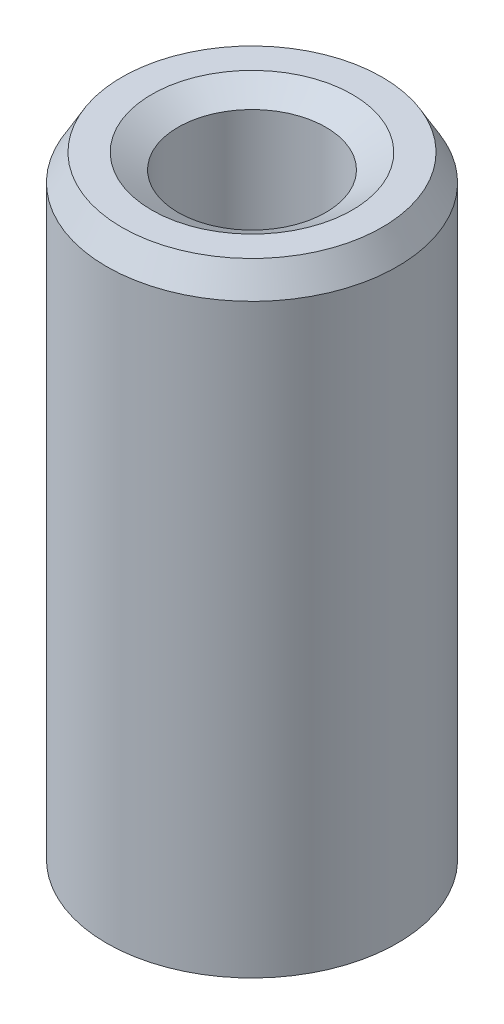
ISO-10303-21;
HEADER;
FILE_DESCRIPTION(('STEP AP214'),'2;1');
FILE_NAME('part.step','',(''),(''),'','','');
FILE_SCHEMA(('AUTOMOTIVE_DESIGN { 1 0 10303 214 1 1 1 1 }'));
ENDSEC;
DATA;
#1=APPLICATION_CONTEXT('core data for automotive mechanical design processes');
#2=APPLICATION_PROTOCOL_DEFINITION('international standard','automotive_design',2000,#1);
#3=PRODUCT_CONTEXT('',#1,'mechanical');
#4=PRODUCT('Part','Part','',(#3));
#5=PRODUCT_RELATED_PRODUCT_CATEGORY('part','',(#4));
#6=PRODUCT_DEFINITION_FORMATION('','',#4);
#7=PRODUCT_DEFINITION_CONTEXT('part definition',#1,'design');
#8=PRODUCT_DEFINITION('design','',#6,#7);
#9=PRODUCT_DEFINITION_SHAPE('','',#8);
#10=(LENGTH_UNIT() NAMED_UNIT(*) SI_UNIT(.MILLI.,.METRE.));
#11=(NAMED_UNIT(*) PLANE_ANGLE_UNIT() SI_UNIT($,.RADIAN.));
#12=(NAMED_UNIT(*) SI_UNIT($,.STERADIAN.) SOLID_ANGLE_UNIT());
#13=UNCERTAINTY_MEASURE_WITH_UNIT(LENGTH_MEASURE(1.E-05),#10,'distance_accuracy_value','');
#14=(GEOMETRIC_REPRESENTATION_CONTEXT(3) GLOBAL_UNCERTAINTY_ASSIGNED_CONTEXT((#13)) GLOBAL_UNIT_ASSIGNED_CONTEXT((#10,
#11,#12)) REPRESENTATION_CONTEXT('',''));
#15=CARTESIAN_POINT('',(0.,0.,0.));
#16=DIRECTION('',(0.,0.,1.));
#17=DIRECTION('',(1.,0.,0.));
#18=AXIS2_PLACEMENT_3D('',#15,#16,#17);
#19=CARTESIAN_POINT('',(0.,32.3775857218825,0.));
#20=DIRECTION('',(0.,-1.,0.));
#21=DIRECTION('',(0.,0.,-1.));
#22=AXIS2_PLACEMENT_3D('',#19,#20,#21);
#23=CYLINDRICAL_SURFACE('',#22,7.5);
#24=CARTESIAN_POINT('',(0.,0.785641217091529,0.));
#25=DIRECTION('',(0.,1.,0.));
#26=DIRECTION('',(0.,0.,1.));
#27=AXIS2_PLACEMENT_3D('',#24,#25,#26);
#28=CIRCLE('',#27,7.5);
#29=CARTESIAN_POINT('',(0.,0.785641217091529,7.5));
#30=VERTEX_POINT('',#29);
#31=EDGE_CURVE('E10',#30,#30,#28,.T.);
#32=ORIENTED_EDGE('',*,*,#31,.T.);
#33=EDGE_LOOP('',(#32));
#34=FACE_BOUND('',#33,.T.);
#35=CARTESIAN_POINT('',(0.,31.0168152173597,0.));
#36=DIRECTION('',(0.,1.,0.));
#37=DIRECTION('',(0.,0.,1.));
#38=AXIS2_PLACEMENT_3D('',#35,#36,#37);
#39=CIRCLE('',#38,7.5);
#40=CARTESIAN_POINT('',(0.,31.0168152173597,7.5));
#41=VERTEX_POINT('',#40);
#42=EDGE_CURVE('E50',#41,#41,#39,.F.);
#43=ORIENTED_EDGE('',*,*,#42,.T.);
#44=EDGE_LOOP('',(#43));
#45=FACE_BOUND('',#44,.T.);
#46=ADVANCED_FACE('F39',(#34,#45),#23,.T.);
#47=CARTESIAN_POINT('',(0.,32.3775857218825,0.));
#48=DIRECTION('',(0.,1.,0.));
#49=DIRECTION('',(0.,0.,1.));
#50=AXIS2_PLACEMENT_3D('',#47,#48,#49);
#51=PLANE('',#50);
#52=CARTESIAN_POINT('',(0.,32.3775857218825,0.));
#53=DIRECTION('',(0.,1.,0.));
#54=DIRECTION('',(0.,0.,1.));
#55=AXIS2_PLACEMENT_3D('',#52,#53,#54);
#56=CIRCLE('',#55,5.1731852317313);
#57=CARTESIAN_POINT('',(0.,32.3775857218825,5.1731852317313));
#58=VERTEX_POINT('',#57);
#59=EDGE_CURVE('E58',#58,#58,#56,.F.);
#60=ORIENTED_EDGE('',*,*,#59,.T.);
#61=EDGE_LOOP('',(#60));
#62=FACE_BOUND('',#61,.T.);
#63=CARTESIAN_POINT('',(0.,32.3775857218825,0.));
#64=DIRECTION('',(0.,1.,0.));
#65=DIRECTION('',(0.,0.,1.));
#66=AXIS2_PLACEMENT_3D('',#63,#64,#65);
#67=CIRCLE('',#66,6.71435878290846);
#68=CARTESIAN_POINT('',(0.,32.3775857218825,6.71435878290846));
#69=VERTEX_POINT('',#68);
#70=EDGE_CURVE('E61',#69,#69,#67,.T.);
#71=ORIENTED_EDGE('',*,*,#70,.T.);
#72=EDGE_LOOP('',(#71));
#73=FACE_BOUND('',#72,.T.);
#74=ADVANCED_FACE('F88',(#62,#73),#51,.T.);
#75=CARTESIAN_POINT('',(0.,0.,0.));
#76=DIRECTION('',(0.,1.,0.));
#77=DIRECTION('',(0.,0.,1.));
#78=AXIS2_PLACEMENT_3D('',#75,#76,#77);
#79=PLANE('',#78);
#80=CARTESIAN_POINT('',(0.,0.,0.));
#81=DIRECTION('',(0.,1.,0.));
#82=DIRECTION('',(0.,0.,1.));
#83=AXIS2_PLACEMENT_3D('',#80,#81,#82);
#84=CIRCLE('',#83,4.59805594430004);
#85=CARTESIAN_POINT('',(0.,0.,4.59805594430004));
#86=VERTEX_POINT('',#85);
#87=EDGE_CURVE('E51',#86,#86,#84,.T.);
#88=ORIENTED_EDGE('',*,*,#87,.T.);
#89=EDGE_LOOP('',(#88));
#90=FACE_BOUND('',#89,.T.);
#91=CARTESIAN_POINT('',(0.,0.,0.));
#92=DIRECTION('',(0.,1.,0.));
#93=DIRECTION('',(0.,0.,1.));
#94=AXIS2_PLACEMENT_3D('',#91,#92,#93);
#95=CIRCLE('',#94,6.13922949547721);
#96=CARTESIAN_POINT('',(0.,0.,6.13922949547721));
#97=VERTEX_POINT('',#96);
#98=EDGE_CURVE('E54',#97,#97,#95,.F.);
#99=ORIENTED_EDGE('',*,*,#98,.T.);
#100=EDGE_LOOP('',(#99));
#101=FACE_BOUND('',#100,.T.);
#102=ADVANCED_FACE('F83',(#90,#101),#79,.F.);
#103=CARTESIAN_POINT('',(0.,32.3775857218825,0.));
#104=DIRECTION('',(0.,-1.,0.));
#105=DIRECTION('',(0.,0.,-1.));
#106=AXIS2_PLACEMENT_3D('',#103,#104,#105);
#107=CYLINDRICAL_SURFACE('',#106,3.8124147272085);
#108=CARTESIAN_POINT('',(0.,31.591944504791,0.));
#109=DIRECTION('',(0.,1.,0.));
#110=DIRECTION('',(0.,0.,1.));
#111=AXIS2_PLACEMENT_3D('',#108,#109,#110);
#112=CIRCLE('',#111,3.8124147272085);
#113=CARTESIAN_POINT('',(0.,31.5919445047909,3.81241472720849));
#114=VERTEX_POINT('',#113);
#115=EDGE_CURVE('E67',#114,#114,#112,.T.);
#116=ORIENTED_EDGE('',*,*,#115,.T.);
#117=EDGE_LOOP('',(#116));
#118=FACE_BOUND('',#117,.T.);
#119=CARTESIAN_POINT('',(0.,1.3607705045228,0.));
#120=DIRECTION('',(0.,1.,0.));
#121=DIRECTION('',(0.,0.,1.));
#122=AXIS2_PLACEMENT_3D('',#119,#120,#121);
#123=CIRCLE('',#122,3.8124147272085);
#124=CARTESIAN_POINT('',(0.,1.3607705045228,3.8124147272085));
#125=VERTEX_POINT('',#124);
#126=EDGE_CURVE('E69',#125,#125,#123,.F.);
#127=ORIENTED_EDGE('',*,*,#126,.T.);
#128=EDGE_LOOP('',(#127));
#129=FACE_BOUND('',#128,.T.);
#130=ADVANCED_FACE('F71',(#118,#129),#107,.F.);
#131=CARTESIAN_POINT('',(0.,31.591944504791,0.));
#132=DIRECTION('',(0.,1.,0.));
#133=DIRECTION('',(0.,0.,1.));
#134=AXIS2_PLACEMENT_3D('',#131,#132,#133);
#135=CONICAL_SURFACE('',#134,3.8124147272085,1.0471975511966);
#136=CARTESIAN_POINT('',(0.,32.3775857218825,5.1731852317313));
#137=CARTESIAN_POINT('',(0.,32.3694019592045,5.15901053897585));
#138=CARTESIAN_POINT('',(0.,32.3612181965264,5.14483584622041));
#139=CARTESIAN_POINT('',(0.,32.3448506711703,5.11648646070952));
#140=CARTESIAN_POINT('',(0.,32.3366669084923,5.10231176795407));
#141=CARTESIAN_POINT('',(0.,32.3202993831362,5.07396238244318));
#142=CARTESIAN_POINT('',(0.,32.3121156204582,5.05978768968773));
#143=CARTESIAN_POINT('',(0.,32.2957480951021,5.03143830417684));
#144=CARTESIAN_POINT('',(0.,32.2875643324241,5.01726361142139));
#145=CARTESIAN_POINT('',(0.,32.271196807068,4.9889142259105));
#146=CARTESIAN_POINT('',(0.,32.26301304439,4.97473953315506));
#147=CARTESIAN_POINT('',(0.,32.2466455190339,4.94639014764416));
#148=CARTESIAN_POINT('',(0.,32.2384617563559,4.93221545488872));
#149=CARTESIAN_POINT('',(0.,32.2220942309998,4.90386606937783));
#150=CARTESIAN_POINT('',(0.,32.2139104683217,4.88969137662238));
#151=CARTESIAN_POINT('',(0.,32.1975429429657,4.86134199111149));
#152=CARTESIAN_POINT('',(0.,32.1893591802876,4.84716729835604));
#153=CARTESIAN_POINT('',(0.,32.1729916549316,4.81881791284515));
#154=CARTESIAN_POINT('',(0.,32.1648078922535,4.80464322008971));
#155=CARTESIAN_POINT('',(0.,32.1484403668975,4.77629383457881));
#156=CARTESIAN_POINT('',(0.,32.1402566042194,4.76211914182337));
#157=CARTESIAN_POINT('',(0.,32.1238890788633,4.73376975631248));
#158=CARTESIAN_POINT('',(0.,32.1157053161853,4.71959506355703));
#159=CARTESIAN_POINT('',(0.,32.0993377908292,4.69124567804614));
#160=CARTESIAN_POINT('',(0.,32.0911540281512,4.67707098529069));
#161=CARTESIAN_POINT('',(0.,32.0747865027951,4.6487215997798));
#162=CARTESIAN_POINT('',(0.,32.0666027401171,4.63454690702436));
#163=CARTESIAN_POINT('',(0.,32.050235214761,4.60619752151346));
#164=CARTESIAN_POINT('',(0.,32.042051452083,4.59202282875802));
#165=CARTESIAN_POINT('',(0.,32.0256839267269,4.56367344324713));
#166=CARTESIAN_POINT('',(0.,32.0175001640489,4.54949875049168));
#167=CARTESIAN_POINT('',(0.,32.0011326386928,4.52114936498079));
#168=CARTESIAN_POINT('',(0.,31.9929488760148,4.50697467222534));
#169=CARTESIAN_POINT('',(0.,31.9765813506587,4.47862528671445));
#170=CARTESIAN_POINT('',(0.,31.9683975879806,4.464450593959));
#171=CARTESIAN_POINT('',(0.,31.9520300626246,4.43610120844811));
#172=CARTESIAN_POINT('',(0.,31.9438462999465,4.42192651569267));
#173=CARTESIAN_POINT('',(0.,31.9274787745905,4.39357713018178));
#174=CARTESIAN_POINT('',(0.,31.9192950119124,4.37940243742633));
#175=CARTESIAN_POINT('',(0.,31.9029274865564,4.35105305191544));
#176=CARTESIAN_POINT('',(0.,31.8947437238783,4.33687835915999));
#177=CARTESIAN_POINT('',(0.,31.8783761985222,4.3085289736491));
#178=CARTESIAN_POINT('',(0.,31.8701924358442,4.29435428089365));
#179=CARTESIAN_POINT('',(0.,31.8538249104881,4.26600489538276));
#180=CARTESIAN_POINT('',(0.,31.8456411478101,4.25183020262732));
#181=CARTESIAN_POINT('',(0.,31.829273622454,4.22348081711642));
#182=CARTESIAN_POINT('',(0.,31.821089859776,4.20930612436098));
#183=CARTESIAN_POINT('',(0.,31.8047223344199,4.18095673885009));
#184=CARTESIAN_POINT('',(0.,31.7965385717419,4.16678204609464));
#185=CARTESIAN_POINT('',(0.,31.7801710463858,4.13843266058375));
#186=CARTESIAN_POINT('',(0.,31.7719872837078,4.1242579678283));
#187=CARTESIAN_POINT('',(0.,31.7556197583517,4.09590858231741));
#188=CARTESIAN_POINT('',(0.,31.7474359956737,4.08173388956197));
#189=CARTESIAN_POINT('',(0.,31.7310684703176,4.05338450405107));
#190=CARTESIAN_POINT('',(0.,31.7228847076395,4.03920981129563));
#191=CARTESIAN_POINT('',(0.,31.7065171822835,4.01086042578474));
#192=CARTESIAN_POINT('',(0.,31.6983334196054,3.99668573302929));
#193=CARTESIAN_POINT('',(0.,31.6819658942494,3.9683363475184));
#194=CARTESIAN_POINT('',(0.,31.6737821315713,3.95416165476295));
#195=CARTESIAN_POINT('',(0.,31.6574146062152,3.92581226925206));
#196=CARTESIAN_POINT('',(0.,31.6492308435372,3.91163757649662));
#197=CARTESIAN_POINT('',(0.,31.6328633181811,3.88328819098572));
#198=CARTESIAN_POINT('',(0.,31.6246795555031,3.86911349823028));
#199=CARTESIAN_POINT('',(0.,31.608312030147,3.84076411271939));
#200=CARTESIAN_POINT('',(0.,31.600128267469,3.82658941996394));
#201=CARTESIAN_POINT('',(0.,31.591944504791,3.81241472720849));
#202=B_SPLINE_CURVE_WITH_KNOTS('',3,(#136,#137,#138,#139,#140,#141,#142,#143,#144,#145,#146,
#147,#148,#149,#150,#151,#152,#153,#154,#155,#156,#157,#158,#159,#160,#161,#162,#163,#164,#165,
#166,#167,#168,#169,#170,#171,#172,#173,#174,#175,#176,#177,#178,#179,#180,#181,#182,#183,#184,
#185,#186,#187,#188,#189,#190,#191,#192,#193,#194,#195,#196,#197,#198,#199,#200,#201),
.UNSPECIFIED.,.F.,.F.,(4,2,2,2,2,2,2,2,2,2,2,2,2,2,2,2,2,2,2,2,2,2,2,2,2,2,2,2,2,2,2,2,4),(0.,
0.0491025760682242,0.0982051521364441,0.147307728204668,0.196410304272888,0.245512880341108,
0.294615456409332,0.343718032477552,0.392820608545772,0.441923184613996,0.491025760682216,
0.540128336750436,0.58923091281866,0.63833348888688,0.6874360649551,0.736538641023324,
0.785641217091544,0.834743793159764,0.883846369227988,0.932948945296208,0.982051521364428,
1.03115409743265,1.08025667350087,1.12935924956909,1.17846182563732,1.22756440170554,
1.27666697777376,1.32576955384198,1.3748721299102,1.42397470597842,1.47307728204664,
1.52217985811486,1.57128243418308),.UNSPECIFIED.);
#203=EDGE_CURVE('BSEAM77',#58,#114,#202,.T.);
#204=ORIENTED_EDGE('',*,*,#59,.F.);
#205=ORIENTED_EDGE('',*,*,#115,.F.);
#206=ORIENTED_EDGE('',*,*,#203,.T.);
#207=ORIENTED_EDGE('',*,*,#203,.F.);
#208=EDGE_LOOP('',(#204,#206,#205,#207));
#209=FACE_BOUND('',#208,.T.);
#210=ADVANCED_FACE('F77',(#209),#135,.F.);
#211=CARTESIAN_POINT('',(0.,0.,0.));
#212=DIRECTION('',(0.,-1.,0.));
#213=DIRECTION('',(0.,0.,-1.));
#214=AXIS2_PLACEMENT_3D('',#211,#212,#213);
#215=CONICAL_SURFACE('',#214,4.59805594430004,0.523598775598296);
#216=ORIENTED_EDGE('',*,*,#126,.F.);
#217=EDGE_LOOP('',(#216));
#218=FACE_BOUND('',#217,.T.);
#219=ORIENTED_EDGE('',*,*,#87,.F.);
#220=EDGE_LOOP('',(#219));
#221=FACE_BOUND('',#220,.T.);
#222=ADVANCED_FACE('F73',(#218,#221),#215,.F.);
#223=CARTESIAN_POINT('',(0.,0.785641217091529,0.));
#224=DIRECTION('',(0.,1.,0.));
#225=DIRECTION('',(0.,0.,1.));
#226=AXIS2_PLACEMENT_3D('',#223,#224,#225);
#227=CONICAL_SURFACE('',#226,7.5,1.0471975511966);
#228=ORIENTED_EDGE('',*,*,#98,.F.);
#229=EDGE_LOOP('',(#228));
#230=FACE_BOUND('',#229,.T.);
#231=ORIENTED_EDGE('',*,*,#31,.F.);
#232=EDGE_LOOP('',(#231));
#233=FACE_BOUND('',#232,.T.);
#234=ADVANCED_FACE('F76',(#230,#233),#227,.T.);
#235=CARTESIAN_POINT('',(0.,32.3775857218825,0.));
#236=DIRECTION('',(0.,-1.,0.));
#237=DIRECTION('',(0.,0.,-1.));
#238=AXIS2_PLACEMENT_3D('',#235,#236,#237);
#239=CONICAL_SURFACE('',#238,6.71435878290846,0.523598775598294);
#240=ORIENTED_EDGE('',*,*,#42,.F.);
#241=EDGE_LOOP('',(#240));
#242=FACE_BOUND('',#241,.T.);
#243=ORIENTED_EDGE('',*,*,#70,.F.);
#244=EDGE_LOOP('',(#243));
#245=FACE_BOUND('',#244,.T.);
#246=ADVANCED_FACE('F45',(#242,#245),#239,.T.);
#247=CLOSED_SHELL('',(#46,#74,#102,#130,#210,#222,#234,#246));
#248=MANIFOLD_SOLID_BREP('B2',#247);
#249=ADVANCED_BREP_SHAPE_REPRESENTATION('',(#18,#248),#14);
#250=SHAPE_DEFINITION_REPRESENTATION(#9,#249);
ENDSEC;
END-ISO-10303-21;
